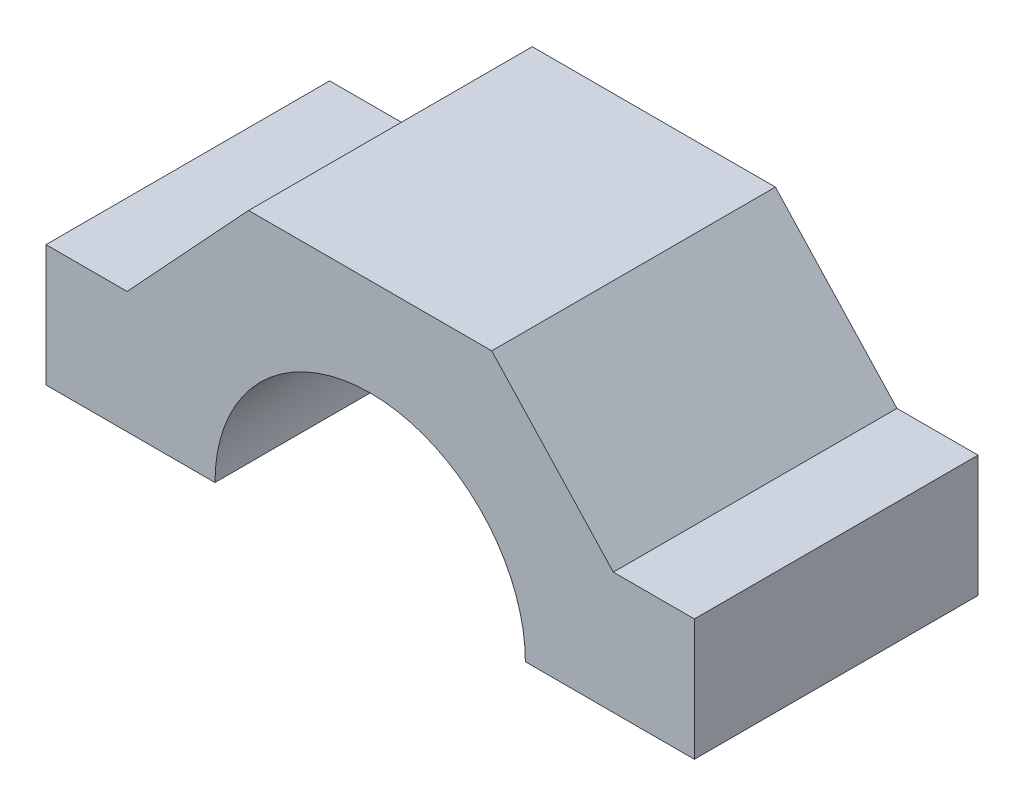
ISO-10303-21;
HEADER;
FILE_DESCRIPTION(('STEP AP214'),'2;1');
FILE_NAME('part.step','',(''),(''),'','','');
FILE_SCHEMA(('AUTOMOTIVE_DESIGN { 1 0 10303 214 1 1 1 1 }'));
ENDSEC;
DATA;
#1=APPLICATION_CONTEXT('core data for automotive mechanical design processes');
#2=APPLICATION_PROTOCOL_DEFINITION('international standard','automotive_design',2000,#1);
#3=PRODUCT_CONTEXT('',#1,'mechanical');
#4=PRODUCT('Part','Part','',(#3));
#5=PRODUCT_RELATED_PRODUCT_CATEGORY('part','',(#4));
#6=PRODUCT_DEFINITION_FORMATION('','',#4);
#7=PRODUCT_DEFINITION_CONTEXT('part definition',#1,'design');
#8=PRODUCT_DEFINITION('design','',#6,#7);
#9=PRODUCT_DEFINITION_SHAPE('','',#8);
#10=(LENGTH_UNIT() NAMED_UNIT(*) SI_UNIT(.MILLI.,.METRE.));
#11=(NAMED_UNIT(*) PLANE_ANGLE_UNIT() SI_UNIT($,.RADIAN.));
#12=(NAMED_UNIT(*) SI_UNIT($,.STERADIAN.) SOLID_ANGLE_UNIT());
#13=UNCERTAINTY_MEASURE_WITH_UNIT(LENGTH_MEASURE(1.E-05),#10,'distance_accuracy_value','');
#14=(GEOMETRIC_REPRESENTATION_CONTEXT(3) GLOBAL_UNCERTAINTY_ASSIGNED_CONTEXT((#13)) GLOBAL_UNIT_ASSIGNED_CONTEXT((#10,
#11,#12)) REPRESENTATION_CONTEXT('',''));
#15=CARTESIAN_POINT('',(0.,0.,0.));
#16=DIRECTION('',(0.,0.,1.));
#17=DIRECTION('',(1.,0.,0.));
#18=AXIS2_PLACEMENT_3D('',#15,#16,#17);
#19=CARTESIAN_POINT('',(-40.,15.,35.));
#20=DIRECTION('',(0.,-1.,0.));
#21=DIRECTION('',(0.,0.,-1.));
#22=AXIS2_PLACEMENT_3D('',#19,#20,#21);
#23=PLANE('',#22);
#24=DIRECTION('',(-1.,0.,0.));
#25=VECTOR('',#24,1.);
#26=CARTESIAN_POINT('',(-40.,15.,0.));
#27=LINE('',#26,#25);
#28=CARTESIAN_POINT('',(-30.,15.,0.));
#29=VERTEX_POINT('',#28);
#30=CARTESIAN_POINT('',(-40.,15.,0.));
#31=VERTEX_POINT('',#30);
#32=EDGE_CURVE('E158',#29,#31,#27,.T.);
#33=ORIENTED_EDGE('',*,*,#32,.T.);
#34=DIRECTION('',(0.,0.,-1.));
#35=VECTOR('',#34,1.);
#36=CARTESIAN_POINT('',(-40.,15.,35.));
#37=LINE('',#36,#35);
#38=CARTESIAN_POINT('',(-40.,15.,35.));
#39=VERTEX_POINT('',#38);
#40=EDGE_CURVE('E11',#39,#31,#37,.T.);
#41=ORIENTED_EDGE('',*,*,#40,.F.);
#42=DIRECTION('',(-1.,0.,0.));
#43=VECTOR('',#42,1.);
#44=CARTESIAN_POINT('',(-40.,15.,35.));
#45=LINE('',#44,#43);
#46=CARTESIAN_POINT('',(-30.,15.,35.));
#47=VERTEX_POINT('',#46);
#48=EDGE_CURVE('E160',#47,#39,#45,.T.);
#49=ORIENTED_EDGE('',*,*,#48,.F.);
#50=DIRECTION('',(0.,0.,-1.));
#51=VECTOR('',#50,1.);
#52=CARTESIAN_POINT('',(-30.,15.,35.));
#53=LINE('',#52,#51);
#54=EDGE_CURVE('E182',#47,#29,#53,.T.);
#55=ORIENTED_EDGE('',*,*,#54,.T.);
#56=EDGE_LOOP('',(#33,#41,#49,#55));
#57=FACE_BOUND('',#56,.T.);
#58=ADVANCED_FACE('F37',(#57),#23,.F.);
#59=CARTESIAN_POINT('',(-40.,0.,35.));
#60=DIRECTION('',(1.,0.,0.));
#61=DIRECTION('',(0.,1.,0.));
#62=AXIS2_PLACEMENT_3D('',#59,#60,#61);
#63=PLANE('',#62);
#64=DIRECTION('',(0.,-1.,0.));
#65=VECTOR('',#64,1.);
#66=CARTESIAN_POINT('',(-40.,0.,0.));
#67=LINE('',#66,#65);
#68=CARTESIAN_POINT('',(-40.,0.,0.));
#69=VERTEX_POINT('',#68);
#70=EDGE_CURVE('E185',#31,#69,#67,.T.);
#71=ORIENTED_EDGE('',*,*,#70,.T.);
#72=DIRECTION('',(0.,0.,-1.));
#73=VECTOR('',#72,1.);
#74=CARTESIAN_POINT('',(-40.,0.,35.));
#75=LINE('',#74,#73);
#76=CARTESIAN_POINT('',(-40.,0.,35.));
#77=VERTEX_POINT('',#76);
#78=EDGE_CURVE('E44',#77,#69,#75,.T.);
#79=ORIENTED_EDGE('',*,*,#78,.F.);
#80=DIRECTION('',(0.,-1.,0.));
#81=VECTOR('',#80,1.);
#82=CARTESIAN_POINT('',(-40.,0.,35.));
#83=LINE('',#82,#81);
#84=EDGE_CURVE('E163',#39,#77,#83,.T.);
#85=ORIENTED_EDGE('',*,*,#84,.F.);
#86=ORIENTED_EDGE('',*,*,#40,.T.);
#87=EDGE_LOOP('',(#71,#79,#85,#86));
#88=FACE_BOUND('',#87,.T.);
#89=ADVANCED_FACE('F235',(#88),#63,.F.);
#90=CARTESIAN_POINT('',(-40.,0.,35.));
#91=DIRECTION('',(0.,1.,0.));
#92=DIRECTION('',(0.,0.,1.));
#93=AXIS2_PLACEMENT_3D('',#90,#91,#92);
#94=PLANE('',#93);
#95=DIRECTION('',(1.,0.,0.));
#96=VECTOR('',#95,1.);
#97=CARTESIAN_POINT('',(-40.,0.,0.));
#98=LINE('',#97,#96);
#99=CARTESIAN_POINT('',(-7.5,0.,0.));
#100=VERTEX_POINT('',#99);
#101=EDGE_CURVE('E131',#69,#100,#98,.T.);
#102=ORIENTED_EDGE('',*,*,#101,.T.);
#103=DIRECTION('',(0.,0.,-1.));
#104=VECTOR('',#103,1.);
#105=CARTESIAN_POINT('',(-7.5,0.,3.));
#106=LINE('',#105,#104);
#107=CARTESIAN_POINT('',(-7.5,0.,3.));
#108=VERTEX_POINT('',#107);
#109=EDGE_CURVE('E125',#108,#100,#106,.T.);
#110=ORIENTED_EDGE('',*,*,#109,.F.);
#111=DIRECTION('',(-1.,0.,0.));
#112=VECTOR('',#111,1.);
#113=CARTESIAN_POINT('',(-7.5,0.,3.));
#114=LINE('',#113,#112);
#115=CARTESIAN_POINT('',(-19.15,0.,3.));
#116=VERTEX_POINT('',#115);
#117=EDGE_CURVE('E128',#108,#116,#114,.T.);
#118=ORIENTED_EDGE('',*,*,#117,.T.);
#119=DIRECTION('',(0.,0.,-1.));
#120=VECTOR('',#119,1.);
#121=CARTESIAN_POINT('',(-19.15,0.,35.));
#122=LINE('',#121,#120);
#123=CARTESIAN_POINT('',(-19.15,0.,35.));
#124=VERTEX_POINT('',#123);
#125=EDGE_CURVE('E51',#124,#116,#122,.T.);
#126=ORIENTED_EDGE('',*,*,#125,.F.);
#127=DIRECTION('',(1.,0.,0.));
#128=VECTOR('',#127,1.);
#129=CARTESIAN_POINT('',(-40.,0.,35.));
#130=LINE('',#129,#128);
#131=EDGE_CURVE('E166',#77,#124,#130,.T.);
#132=ORIENTED_EDGE('',*,*,#131,.F.);
#133=ORIENTED_EDGE('',*,*,#78,.T.);
#134=EDGE_LOOP('',(#102,#110,#118,#126,#132,#133));
#135=FACE_BOUND('',#134,.T.);
#136=ADVANCED_FACE('F127',(#135),#94,.F.);
#137=CARTESIAN_POINT('',(0.,0.,35.));
#138=DIRECTION('',(0.,0.,-1.));
#139=DIRECTION('',(-1.,0.,0.));
#140=AXIS2_PLACEMENT_3D('',#137,#138,#139);
#141=CYLINDRICAL_SURFACE('',#140,19.15);
#142=ORIENTED_EDGE('',*,*,#125,.T.);
#143=CARTESIAN_POINT('',(0.,0.,3.));
#144=DIRECTION('',(0.,0.,-1.));
#145=DIRECTION('',(-1.,0.,0.));
#146=AXIS2_PLACEMENT_3D('',#143,#144,#145);
#147=CIRCLE('',#146,19.15);
#148=CARTESIAN_POINT('',(19.15,0.,3.));
#149=VERTEX_POINT('',#148);
#150=EDGE_CURVE('E55',#116,#149,#147,.T.);
#151=ORIENTED_EDGE('',*,*,#150,.T.);
#152=DIRECTION('',(0.,0.,-1.));
#153=VECTOR('',#152,1.);
#154=CARTESIAN_POINT('',(19.15,0.,35.));
#155=LINE('',#154,#153);
#156=CARTESIAN_POINT('',(19.15,0.,35.));
#157=VERTEX_POINT('',#156);
#158=EDGE_CURVE('E216',#157,#149,#155,.T.);
#159=ORIENTED_EDGE('',*,*,#158,.F.);
#160=CARTESIAN_POINT('',(0.,0.,35.));
#161=DIRECTION('',(0.,0.,-1.));
#162=DIRECTION('',(-1.,0.,0.));
#163=AXIS2_PLACEMENT_3D('',#160,#161,#162);
#164=CIRCLE('',#163,19.15);
#165=EDGE_CURVE('E168',#124,#157,#164,.T.);
#166=ORIENTED_EDGE('',*,*,#165,.F.);
#167=EDGE_LOOP('',(#142,#151,#159,#166));
#168=FACE_BOUND('',#167,.T.);
#169=ADVANCED_FACE('F230',(#168),#141,.F.);
#170=CARTESIAN_POINT('',(19.15,0.,35.));
#171=DIRECTION('',(0.,1.,0.));
#172=DIRECTION('',(-1.,0.,0.));
#173=AXIS2_PLACEMENT_3D('',#170,#171,#172);
#174=PLANE('',#173);
#175=DIRECTION('',(1.,0.,0.));
#176=VECTOR('',#175,1.);
#177=CARTESIAN_POINT('',(19.15,0.,0.));
#178=LINE('',#177,#176);
#179=CARTESIAN_POINT('',(7.5,0.,0.));
#180=VERTEX_POINT('',#179);
#181=CARTESIAN_POINT('',(40.,0.,0.));
#182=VERTEX_POINT('',#181);
#183=EDGE_CURVE('E188',#180,#182,#178,.T.);
#184=ORIENTED_EDGE('',*,*,#183,.T.);
#185=DIRECTION('',(0.,0.,-1.));
#186=VECTOR('',#185,1.);
#187=CARTESIAN_POINT('',(40.,0.,35.));
#188=LINE('',#187,#186);
#189=CARTESIAN_POINT('',(40.,0.,35.));
#190=VERTEX_POINT('',#189);
#191=EDGE_CURVE('E213',#190,#182,#188,.T.);
#192=ORIENTED_EDGE('',*,*,#191,.F.);
#193=DIRECTION('',(1.,0.,0.));
#194=VECTOR('',#193,1.);
#195=CARTESIAN_POINT('',(19.15,0.,35.));
#196=LINE('',#195,#194);
#197=EDGE_CURVE('E170',#157,#190,#196,.T.);
#198=ORIENTED_EDGE('',*,*,#197,.F.);
#199=ORIENTED_EDGE('',*,*,#158,.T.);
#200=DIRECTION('',(-1.,0.,0.));
#201=VECTOR('',#200,1.);
#202=CARTESIAN_POINT('',(19.15,0.,3.));
#203=LINE('',#202,#201);
#204=CARTESIAN_POINT('',(7.5,0.,3.));
#205=VERTEX_POINT('',#204);
#206=EDGE_CURVE('E137',#149,#205,#203,.T.);
#207=ORIENTED_EDGE('',*,*,#206,.T.);
#208=DIRECTION('',(0.,0.,-1.));
#209=VECTOR('',#208,1.);
#210=CARTESIAN_POINT('',(7.5,0.,3.));
#211=LINE('',#210,#209);
#212=EDGE_CURVE('E136',#205,#180,#211,.T.);
#213=ORIENTED_EDGE('',*,*,#212,.T.);
#214=EDGE_LOOP('',(#184,#192,#198,#199,#207,#213));
#215=FACE_BOUND('',#214,.T.);
#216=ADVANCED_FACE('F228',(#215),#174,.F.);
#217=CARTESIAN_POINT('',(40.,0.,35.));
#218=DIRECTION('',(-1.,0.,0.));
#219=DIRECTION('',(0.,-1.,0.));
#220=AXIS2_PLACEMENT_3D('',#217,#218,#219);
#221=PLANE('',#220);
#222=DIRECTION('',(0.,1.,0.));
#223=VECTOR('',#222,1.);
#224=CARTESIAN_POINT('',(40.,0.,0.));
#225=LINE('',#224,#223);
#226=CARTESIAN_POINT('',(40.,15.,0.));
#227=VERTEX_POINT('',#226);
#228=EDGE_CURVE('E190',#182,#227,#225,.T.);
#229=ORIENTED_EDGE('',*,*,#228,.T.);
#230=DIRECTION('',(0.,0.,-1.));
#231=VECTOR('',#230,1.);
#232=CARTESIAN_POINT('',(40.,15.,35.));
#233=LINE('',#232,#231);
#234=CARTESIAN_POINT('',(40.,15.,35.));
#235=VERTEX_POINT('',#234);
#236=EDGE_CURVE('E210',#235,#227,#233,.T.);
#237=ORIENTED_EDGE('',*,*,#236,.F.);
#238=DIRECTION('',(0.,1.,0.));
#239=VECTOR('',#238,1.);
#240=CARTESIAN_POINT('',(40.,0.,35.));
#241=LINE('',#240,#239);
#242=EDGE_CURVE('E172',#190,#235,#241,.T.);
#243=ORIENTED_EDGE('',*,*,#242,.F.);
#244=ORIENTED_EDGE('',*,*,#191,.T.);
#245=EDGE_LOOP('',(#229,#237,#243,#244));
#246=FACE_BOUND('',#245,.T.);
#247=ADVANCED_FACE('F259',(#246),#221,.F.);
#248=CARTESIAN_POINT('',(40.,15.,35.));
#249=DIRECTION('',(0.,-1.,0.));
#250=DIRECTION('',(1.,0.,0.));
#251=AXIS2_PLACEMENT_3D('',#248,#249,#250);
#252=PLANE('',#251);
#253=DIRECTION('',(-1.,0.,0.));
#254=VECTOR('',#253,1.);
#255=CARTESIAN_POINT('',(40.,15.,0.));
#256=LINE('',#255,#254);
#257=CARTESIAN_POINT('',(30.,15.,0.));
#258=VERTEX_POINT('',#257);
#259=EDGE_CURVE('E192',#227,#258,#256,.T.);
#260=ORIENTED_EDGE('',*,*,#259,.T.);
#261=DIRECTION('',(0.,0.,-1.));
#262=VECTOR('',#261,1.);
#263=CARTESIAN_POINT('',(30.,15.,35.));
#264=LINE('',#263,#262);
#265=CARTESIAN_POINT('',(30.,15.,35.));
#266=VERTEX_POINT('',#265);
#267=EDGE_CURVE('E207',#266,#258,#264,.T.);
#268=ORIENTED_EDGE('',*,*,#267,.F.);
#269=DIRECTION('',(-1.,0.,0.));
#270=VECTOR('',#269,1.);
#271=CARTESIAN_POINT('',(40.,15.,35.));
#272=LINE('',#271,#270);
#273=EDGE_CURVE('E174',#235,#266,#272,.T.);
#274=ORIENTED_EDGE('',*,*,#273,.F.);
#275=ORIENTED_EDGE('',*,*,#236,.T.);
#276=EDGE_LOOP('',(#260,#268,#274,#275));
#277=FACE_BOUND('',#276,.T.);
#278=ADVANCED_FACE('F254',(#277),#252,.F.);
#279=CARTESIAN_POINT('',(30.,15.,35.));
#280=DIRECTION('',(-0.732712691982594,-0.680538104008601,0.));
#281=DIRECTION('',(0.680538104008601,-0.732712691982594,0.));
#282=AXIS2_PLACEMENT_3D('',#279,#280,#281);
#283=PLANE('',#282);
#284=DIRECTION('',(-0.680538104008601,0.732712691982594,0.));
#285=VECTOR('',#284,1.);
#286=CARTESIAN_POINT('',(30.,15.,0.));
#287=LINE('',#286,#285);
#288=CARTESIAN_POINT('',(15.,31.15,0.));
#289=VERTEX_POINT('',#288);
#290=EDGE_CURVE('E194',#258,#289,#287,.T.);
#291=ORIENTED_EDGE('',*,*,#290,.T.);
#292=DIRECTION('',(0.,0.,-1.));
#293=VECTOR('',#292,1.);
#294=CARTESIAN_POINT('',(15.,31.15,35.));
#295=LINE('',#294,#293);
#296=CARTESIAN_POINT('',(15.,31.15,35.));
#297=VERTEX_POINT('',#296);
#298=EDGE_CURVE('E204',#297,#289,#295,.T.);
#299=ORIENTED_EDGE('',*,*,#298,.F.);
#300=DIRECTION('',(-0.680538104008601,0.732712691982594,0.));
#301=VECTOR('',#300,1.);
#302=CARTESIAN_POINT('',(30.,15.,35.));
#303=LINE('',#302,#301);
#304=EDGE_CURVE('E176',#266,#297,#303,.T.);
#305=ORIENTED_EDGE('',*,*,#304,.F.);
#306=ORIENTED_EDGE('',*,*,#267,.T.);
#307=EDGE_LOOP('',(#291,#299,#305,#306));
#308=FACE_BOUND('',#307,.T.);
#309=ADVANCED_FACE('F251',(#308),#283,.F.);
#310=CARTESIAN_POINT('',(-15.,31.15,35.));
#311=DIRECTION('',(0.,-1.,0.));
#312=DIRECTION('',(1.,0.,0.));
#313=AXIS2_PLACEMENT_3D('',#310,#311,#312);
#314=PLANE('',#313);
#315=DIRECTION('',(-1.,0.,0.));
#316=VECTOR('',#315,1.);
#317=CARTESIAN_POINT('',(-15.,31.15,0.));
#318=LINE('',#317,#316);
#319=CARTESIAN_POINT('',(-15.,31.15,0.));
#320=VERTEX_POINT('',#319);
#321=EDGE_CURVE('E196',#289,#320,#318,.T.);
#322=ORIENTED_EDGE('',*,*,#321,.T.);
#323=DIRECTION('',(0.,0.,-1.));
#324=VECTOR('',#323,1.);
#325=CARTESIAN_POINT('',(-15.,31.15,35.));
#326=LINE('',#325,#324);
#327=CARTESIAN_POINT('',(-15.,31.15,35.));
#328=VERTEX_POINT('',#327);
#329=EDGE_CURVE('E201',#328,#320,#326,.T.);
#330=ORIENTED_EDGE('',*,*,#329,.F.);
#331=DIRECTION('',(-1.,0.,0.));
#332=VECTOR('',#331,1.);
#333=CARTESIAN_POINT('',(-15.,31.15,35.));
#334=LINE('',#333,#332);
#335=EDGE_CURVE('E178',#297,#328,#334,.T.);
#336=ORIENTED_EDGE('',*,*,#335,.F.);
#337=ORIENTED_EDGE('',*,*,#298,.T.);
#338=EDGE_LOOP('',(#322,#330,#336,#337));
#339=FACE_BOUND('',#338,.T.);
#340=ADVANCED_FACE('F247',(#339),#314,.F.);
#341=CARTESIAN_POINT('',(-30.,15.,35.));
#342=DIRECTION('',(0.732712691982594,-0.680538104008601,0.));
#343=DIRECTION('',(0.680538104008601,0.732712691982594,0.));
#344=AXIS2_PLACEMENT_3D('',#341,#342,#343);
#345=PLANE('',#344);
#346=DIRECTION('',(-0.680538104008601,-0.732712691982594,0.));
#347=VECTOR('',#346,1.);
#348=CARTESIAN_POINT('',(-30.,15.,0.));
#349=LINE('',#348,#347);
#350=EDGE_CURVE('E164',#320,#29,#349,.T.);
#351=ORIENTED_EDGE('',*,*,#350,.T.);
#352=ORIENTED_EDGE('',*,*,#54,.F.);
#353=DIRECTION('',(-0.680538104008601,-0.732712691982594,0.));
#354=VECTOR('',#353,1.);
#355=CARTESIAN_POINT('',(-30.,15.,35.));
#356=LINE('',#355,#354);
#357=EDGE_CURVE('E180',#328,#47,#356,.T.);
#358=ORIENTED_EDGE('',*,*,#357,.F.);
#359=ORIENTED_EDGE('',*,*,#329,.T.);
#360=EDGE_LOOP('',(#351,#352,#358,#359));
#361=FACE_BOUND('',#360,.T.);
#362=ADVANCED_FACE('F242',(#361),#345,.F.);
#363=CARTESIAN_POINT('',(0.,0.,35.));
#364=DIRECTION('',(0.,0.,-1.));
#365=DIRECTION('',(-1.,0.,0.));
#366=AXIS2_PLACEMENT_3D('',#363,#364,#365);
#367=PLANE('',#366);
#368=ORIENTED_EDGE('',*,*,#48,.T.);
#369=ORIENTED_EDGE('',*,*,#84,.T.);
#370=ORIENTED_EDGE('',*,*,#131,.T.);
#371=ORIENTED_EDGE('',*,*,#165,.T.);
#372=ORIENTED_EDGE('',*,*,#197,.T.);
#373=ORIENTED_EDGE('',*,*,#242,.T.);
#374=ORIENTED_EDGE('',*,*,#273,.T.);
#375=ORIENTED_EDGE('',*,*,#304,.T.);
#376=ORIENTED_EDGE('',*,*,#335,.T.);
#377=ORIENTED_EDGE('',*,*,#357,.T.);
#378=EDGE_LOOP('',(#368,#369,#370,#371,#372,#373,#374,#375,#376,#377));
#379=FACE_BOUND('',#378,.T.);
#380=ADVANCED_FACE('F232',(#379),#367,.F.);
#381=CARTESIAN_POINT('',(0.,0.,0.));
#382=DIRECTION('',(0.,0.,-1.));
#383=DIRECTION('',(-1.,0.,0.));
#384=AXIS2_PLACEMENT_3D('',#381,#382,#383);
#385=PLANE('',#384);
#386=CARTESIAN_POINT('',(9.19238815542513,9.1923881554251,0.));
#387=DIRECTION('',(0.,0.,1.));
#388=DIRECTION('',(1.,0.,0.));
#389=AXIS2_PLACEMENT_3D('',#386,#387,#388);
#390=CIRCLE('',#389,1.5);
#391=CARTESIAN_POINT('',(10.6923881554251,9.1923881554251,0.));
#392=VERTEX_POINT('',#391);
#393=EDGE_CURVE('E150',#392,#392,#390,.T.);
#394=ORIENTED_EDGE('',*,*,#393,.T.);
#395=EDGE_LOOP('',(#394));
#396=FACE_BOUND('',#395,.T.);
#397=CARTESIAN_POINT('',(-9.19238815542513,9.1923881554251,0.));
#398=DIRECTION('',(0.,0.,1.));
#399=DIRECTION('',(-1.,0.,0.));
#400=AXIS2_PLACEMENT_3D('',#397,#398,#399);
#401=CIRCLE('',#400,1.5);
#402=CARTESIAN_POINT('',(-10.6923881554251,9.1923881554251,0.));
#403=VERTEX_POINT('',#402);
#404=EDGE_CURVE('E407',#403,#403,#401,.T.);
#405=ORIENTED_EDGE('',*,*,#404,.T.);
#406=EDGE_LOOP('',(#405));
#407=FACE_BOUND('',#406,.T.);
#408=ORIENTED_EDGE('',*,*,#32,.F.);
#409=ORIENTED_EDGE('',*,*,#350,.F.);
#410=ORIENTED_EDGE('',*,*,#321,.F.);
#411=ORIENTED_EDGE('',*,*,#290,.F.);
#412=ORIENTED_EDGE('',*,*,#259,.F.);
#413=ORIENTED_EDGE('',*,*,#228,.F.);
#414=ORIENTED_EDGE('',*,*,#183,.F.);
#415=CARTESIAN_POINT('',(0.,0.,0.));
#416=DIRECTION('',(0.,0.,1.));
#417=DIRECTION('',(1.,0.,0.));
#418=AXIS2_PLACEMENT_3D('',#415,#416,#417);
#419=CIRCLE('',#418,7.5);
#420=EDGE_CURVE('E148',#180,#100,#419,.T.);
#421=ORIENTED_EDGE('',*,*,#420,.T.);
#422=ORIENTED_EDGE('',*,*,#101,.F.);
#423=ORIENTED_EDGE('',*,*,#70,.F.);
#424=EDGE_LOOP('',(#408,#409,#410,#411,#412,#413,#414,#421,#422,#423));
#425=FACE_BOUND('',#424,.T.);
#426=ADVANCED_FACE('F223',(#396,#407,#425),#385,.T.);
#427=CARTESIAN_POINT('',(0.,0.,3.));
#428=DIRECTION('',(0.,0.,-1.));
#429=DIRECTION('',(-1.,0.,0.));
#430=AXIS2_PLACEMENT_3D('',#427,#428,#429);
#431=CYLINDRICAL_SURFACE('',#430,7.5);
#432=ORIENTED_EDGE('',*,*,#420,.F.);
#433=ORIENTED_EDGE('',*,*,#212,.F.);
#434=CARTESIAN_POINT('',(0.,0.,3.));
#435=DIRECTION('',(0.,0.,1.));
#436=DIRECTION('',(1.,0.,0.));
#437=AXIS2_PLACEMENT_3D('',#434,#435,#436);
#438=CIRCLE('',#437,7.5);
#439=EDGE_CURVE('E143',#205,#108,#438,.T.);
#440=ORIENTED_EDGE('',*,*,#439,.T.);
#441=ORIENTED_EDGE('',*,*,#109,.T.);
#442=EDGE_LOOP('',(#432,#433,#440,#441));
#443=FACE_BOUND('',#442,.T.);
#444=ADVANCED_FACE('F146',(#443),#431,.F.);
#445=CARTESIAN_POINT('',(0.,0.,3.));
#446=DIRECTION('',(0.,0.,1.));
#447=DIRECTION('',(1.,0.,0.));
#448=AXIS2_PLACEMENT_3D('',#445,#446,#447);
#449=PLANE('',#448);
#450=CARTESIAN_POINT('',(9.19238815542513,9.1923881554251,3.));
#451=DIRECTION('',(0.,0.,1.));
#452=DIRECTION('',(1.,0.,0.));
#453=AXIS2_PLACEMENT_3D('',#450,#451,#452);
#454=CIRCLE('',#453,1.5);
#455=CARTESIAN_POINT('',(10.6923881554251,9.1923881554251,3.));
#456=VERTEX_POINT('',#455);
#457=EDGE_CURVE('E406',#456,#456,#454,.T.);
#458=ORIENTED_EDGE('',*,*,#457,.F.);
#459=EDGE_LOOP('',(#458));
#460=FACE_BOUND('',#459,.T.);
#461=CARTESIAN_POINT('',(-9.19238815542513,9.1923881554251,3.));
#462=DIRECTION('',(0.,0.,1.));
#463=DIRECTION('',(-1.,0.,0.));
#464=AXIS2_PLACEMENT_3D('',#461,#462,#463);
#465=CIRCLE('',#464,1.5);
#466=CARTESIAN_POINT('',(-10.6923881554251,9.1923881554251,3.));
#467=VERTEX_POINT('',#466);
#468=EDGE_CURVE('E153',#467,#467,#465,.T.);
#469=ORIENTED_EDGE('',*,*,#468,.F.);
#470=EDGE_LOOP('',(#469));
#471=FACE_BOUND('',#470,.T.);
#472=ORIENTED_EDGE('',*,*,#439,.F.);
#473=ORIENTED_EDGE('',*,*,#206,.F.);
#474=ORIENTED_EDGE('',*,*,#150,.F.);
#475=ORIENTED_EDGE('',*,*,#117,.F.);
#476=EDGE_LOOP('',(#472,#473,#474,#475));
#477=FACE_BOUND('',#476,.T.);
#478=ADVANCED_FACE('F141',(#460,#471,#477),#449,.T.);
#479=CARTESIAN_POINT('',(-9.19238815542513,9.1923881554251,0.));
#480=DIRECTION('',(0.,0.,1.));
#481=DIRECTION('',(1.,0.,0.));
#482=AXIS2_PLACEMENT_3D('',#479,#480,#481);
#483=CYLINDRICAL_SURFACE('',#482,1.5);
#484=ORIENTED_EDGE('',*,*,#404,.F.);
#485=EDGE_LOOP('',(#484));
#486=FACE_BOUND('',#485,.T.);
#487=ORIENTED_EDGE('',*,*,#468,.T.);
#488=EDGE_LOOP('',(#487));
#489=FACE_BOUND('',#488,.T.);
#490=ADVANCED_FACE('F316',(#486,#489),#483,.F.);
#491=CARTESIAN_POINT('',(9.19238815542513,9.1923881554251,0.));
#492=DIRECTION('',(0.,0.,1.));
#493=DIRECTION('',(1.,0.,0.));
#494=AXIS2_PLACEMENT_3D('',#491,#492,#493);
#495=CYLINDRICAL_SURFACE('',#494,1.5);
#496=ORIENTED_EDGE('',*,*,#393,.F.);
#497=EDGE_LOOP('',(#496));
#498=FACE_BOUND('',#497,.T.);
#499=ORIENTED_EDGE('',*,*,#457,.T.);
#500=EDGE_LOOP('',(#499));
#501=FACE_BOUND('',#500,.T.);
#502=ADVANCED_FACE('F326',(#498,#501),#495,.F.);
#503=CLOSED_SHELL('',(#58,#89,#136,#169,#216,#247,#278,#309,#340,#362,#380,#426,#444,#478,#490,#502));
#504=MANIFOLD_SOLID_BREP('B2',#503);
#505=ADVANCED_BREP_SHAPE_REPRESENTATION('',(#18,#504),#14);
#506=SHAPE_DEFINITION_REPRESENTATION(#9,#505);
ENDSEC;
END-ISO-10303-21;
